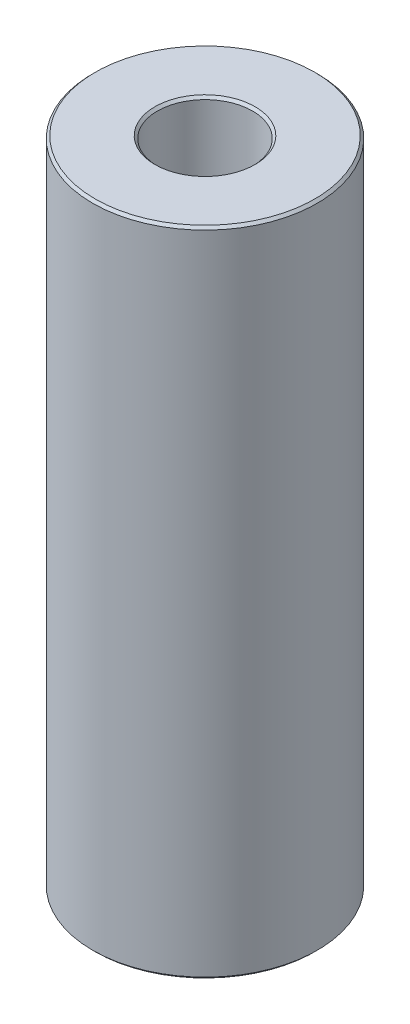
ISO-10303-21;
HEADER;
FILE_DESCRIPTION(('STEP AP214'),'2;1');
FILE_NAME('part.step','',(''),(''),'','','');
FILE_SCHEMA(('AUTOMOTIVE_DESIGN { 1 0 10303 214 1 1 1 1 }'));
ENDSEC;
DATA;
#1=APPLICATION_CONTEXT('core data for automotive mechanical design processes');
#2=APPLICATION_PROTOCOL_DEFINITION('international standard','automotive_design',2000,#1);
#3=PRODUCT_CONTEXT('',#1,'mechanical');
#4=PRODUCT('Part','Part','',(#3));
#5=PRODUCT_RELATED_PRODUCT_CATEGORY('part','',(#4));
#6=PRODUCT_DEFINITION_FORMATION('','',#4);
#7=PRODUCT_DEFINITION_CONTEXT('part definition',#1,'design');
#8=PRODUCT_DEFINITION('design','',#6,#7);
#9=PRODUCT_DEFINITION_SHAPE('','',#8);
#10=(LENGTH_UNIT() NAMED_UNIT(*) SI_UNIT(.MILLI.,.METRE.));
#11=(NAMED_UNIT(*) PLANE_ANGLE_UNIT() SI_UNIT($,.RADIAN.));
#12=(NAMED_UNIT(*) SI_UNIT($,.STERADIAN.) SOLID_ANGLE_UNIT());
#13=UNCERTAINTY_MEASURE_WITH_UNIT(LENGTH_MEASURE(1.E-05),#10,'distance_accuracy_value','');
#14=(GEOMETRIC_REPRESENTATION_CONTEXT(3) GLOBAL_UNCERTAINTY_ASSIGNED_CONTEXT((#13)) GLOBAL_UNIT_ASSIGNED_CONTEXT((#10,
#11,#12)) REPRESENTATION_CONTEXT('',''));
#15=CARTESIAN_POINT('',(0.,0.,0.));
#16=DIRECTION('',(0.,0.,1.));
#17=DIRECTION('',(1.,0.,0.));
#18=AXIS2_PLACEMENT_3D('',#15,#16,#17);
#19=CARTESIAN_POINT('',(0.,101.614682838386,0.));
#20=DIRECTION('',(0.,-1.,0.));
#21=DIRECTION('',(0.,0.,-1.));
#22=AXIS2_PLACEMENT_3D('',#19,#20,#21);
#23=CYLINDRICAL_SURFACE('',#22,17.5);
#24=CARTESIAN_POINT('',(0.,0.387153320517516,0.));
#25=DIRECTION('',(0.,1.,0.));
#26=DIRECTION('',(0.,0.,1.));
#27=AXIS2_PLACEMENT_3D('',#24,#25,#26);
#28=CIRCLE('',#27,17.5);
#29=CARTESIAN_POINT('',(0.,0.387153320517516,-17.5));
#30=VERTEX_POINT('',#29);
#31=EDGE_CURVE('E10',#30,#30,#28,.T.);
#32=CARTESIAN_POINT('',(0.,101.227529517869,0.));
#33=DIRECTION('',(0.,1.,0.));
#34=DIRECTION('',(0.,0.,1.));
#35=AXIS2_PLACEMENT_3D('',#32,#33,#34);
#36=CIRCLE('',#35,17.5);
#37=CARTESIAN_POINT('',(0.,101.227529517869,-17.5));
#38=VERTEX_POINT('',#37);
#39=EDGE_CURVE('E50',#38,#38,#36,.F.);
#40=CARTESIAN_POINT('',(0.,0.387153320517516,-17.5));
#41=CARTESIAN_POINT('',(0.,1.43757390590659,-17.5));
#42=CARTESIAN_POINT('',(0.,2.48799449129567,-17.5));
#43=CARTESIAN_POINT('',(0.,4.58883566207383,-17.5));
#44=CARTESIAN_POINT('',(0.,5.63925624746291,-17.5));
#45=CARTESIAN_POINT('',(0.,7.74009741824106,-17.5));
#46=CARTESIAN_POINT('',(0.,8.79051800363014,-17.5));
#47=CARTESIAN_POINT('',(0.,10.8913591744083,-17.5));
#48=CARTESIAN_POINT('',(0.,11.9417797597974,-17.5));
#49=CARTESIAN_POINT('',(0.,14.0426209305755,-17.5));
#50=CARTESIAN_POINT('',(0.,15.0930415159646,-17.5));
#51=CARTESIAN_POINT('',(0.,17.1938826867428,-17.5));
#52=CARTESIAN_POINT('',(0.,18.2443032721318,-17.5));
#53=CARTESIAN_POINT('',(0.,20.34514444291,-17.5));
#54=CARTESIAN_POINT('',(0.,21.3955650282991,-17.5));
#55=CARTESIAN_POINT('',(0.,23.4964061990772,-17.5));
#56=CARTESIAN_POINT('',(0.,24.5468267844663,-17.5));
#57=CARTESIAN_POINT('',(0.,26.6476679552445,-17.5));
#58=CARTESIAN_POINT('',(0.,27.6980885406335,-17.5));
#59=CARTESIAN_POINT('',(0.,29.7989297114117,-17.5));
#60=CARTESIAN_POINT('',(0.,30.8493502968008,-17.5));
#61=CARTESIAN_POINT('',(0.,32.9501914675789,-17.5));
#62=CARTESIAN_POINT('',(0.,34.000612052968,-17.5));
#63=CARTESIAN_POINT('',(0.,36.1014532237462,-17.5));
#64=CARTESIAN_POINT('',(0.,37.1518738091352,-17.5));
#65=CARTESIAN_POINT('',(0.,39.2527149799134,-17.5));
#66=CARTESIAN_POINT('',(0.,40.3031355653025,-17.5));
#67=CARTESIAN_POINT('',(0.,42.4039767360806,-17.5));
#68=CARTESIAN_POINT('',(0.,43.4543973214697,-17.5));
#69=CARTESIAN_POINT('',(0.,45.5552384922479,-17.5));
#70=CARTESIAN_POINT('',(0.,46.6056590776369,-17.5));
#71=CARTESIAN_POINT('',(0.,48.7065002484151,-17.5));
#72=CARTESIAN_POINT('',(0.,49.7569208338042,-17.5));
#73=CARTESIAN_POINT('',(0.,51.8577620045823,-17.5));
#74=CARTESIAN_POINT('',(0.,52.9081825899714,-17.5));
#75=CARTESIAN_POINT('',(0.,55.0090237607495,-17.5));
#76=CARTESIAN_POINT('',(0.,56.0594443461386,-17.5));
#77=CARTESIAN_POINT('',(0.,58.1602855169168,-17.5));
#78=CARTESIAN_POINT('',(0.,59.2107061023059,-17.5));
#79=CARTESIAN_POINT('',(0.,61.311547273084,-17.5));
#80=CARTESIAN_POINT('',(0.,62.3619678584731,-17.5));
#81=CARTESIAN_POINT('',(0.,64.4628090292513,-17.5));
#82=CARTESIAN_POINT('',(0.,65.5132296146403,-17.5));
#83=CARTESIAN_POINT('',(0.,67.6140707854185,-17.5));
#84=CARTESIAN_POINT('',(0.,68.6644913708076,-17.5));
#85=CARTESIAN_POINT('',(0.,70.7653325415857,-17.5));
#86=CARTESIAN_POINT('',(0.,71.8157531269748,-17.5));
#87=CARTESIAN_POINT('',(0.,73.916594297753,-17.5));
#88=CARTESIAN_POINT('',(0.,74.967014883142,-17.5));
#89=CARTESIAN_POINT('',(0.,77.0678560539202,-17.5));
#90=CARTESIAN_POINT('',(0.,78.1182766393093,-17.5));
#91=CARTESIAN_POINT('',(0.,80.2191178100874,-17.5));
#92=CARTESIAN_POINT('',(0.,81.2695383954765,-17.5));
#93=CARTESIAN_POINT('',(0.,83.3703795662547,-17.5));
#94=CARTESIAN_POINT('',(0.,84.4208001516437,-17.5));
#95=CARTESIAN_POINT('',(0.,86.5216413224219,-17.5));
#96=CARTESIAN_POINT('',(0.,87.572061907811,-17.5));
#97=CARTESIAN_POINT('',(0.,89.6729030785891,-17.5));
#98=CARTESIAN_POINT('',(0.,90.7233236639782,-17.5));
#99=CARTESIAN_POINT('',(0.,92.8241648347563,-17.5));
#100=CARTESIAN_POINT('',(0.,93.8745854201454,-17.5));
#101=CARTESIAN_POINT('',(0.,95.9754265909236,-17.5));
#102=CARTESIAN_POINT('',(0.,97.0258471763127,-17.5));
#103=CARTESIAN_POINT('',(0.,99.1266883470908,-17.5));
#104=CARTESIAN_POINT('',(0.,100.17710893248,-17.5));
#105=CARTESIAN_POINT('',(0.,101.227529517869,-17.5));
#106=B_SPLINE_CURVE_WITH_KNOTS('',3,(#40,#41,#42,#43,#44,#45,#46,#47,#48,#49,#50,#51,#52,#53,
#54,#55,#56,#57,#58,#59,#60,#61,#62,#63,#64,#65,#66,#67,#68,#69,#70,#71,#72,#73,#74,#75,#76,#77,
#78,#79,#80,#81,#82,#83,#84,#85,#86,#87,#88,#89,#90,#91,#92,#93,#94,#95,#96,#97,#98,#99,#100,
#101,#102,#103,#104,#105),.UNSPECIFIED.,.F.,.F.,(4,2,2,2,2,2,2,2,2,2,2,2,2,2,2,2,2,2,2,2,2,2,2,
2,2,2,2,2,2,2,2,2,4),(0.,3.15126175616723,6.30252351233447,9.4537852685017,12.6050470246689,
15.7563087808362,18.9075705370034,22.0588322931706,25.2100940493379,28.3613558055051,
31.5126175616723,34.6638793178396,37.8151410740068,40.966402830174,44.1176645863413,
47.2689263425085,50.4201880986757,53.571449854843,56.7227116110102,59.8739733671774,
63.0252351233447,66.1764968795119,69.3277586356791,72.4790203918463,75.6302821480136,
78.7815439041808,81.9328056603481,85.0840674165153,88.2353291726825,91.3865909288498,
94.537852685017,97.6891144411842,100.840376197351),.UNSPECIFIED.);
#107=EDGE_CURVE('BSEAM39',#30,#38,#106,.T.);
#108=ORIENTED_EDGE('',*,*,#31,.T.);
#109=ORIENTED_EDGE('',*,*,#39,.T.);
#110=ORIENTED_EDGE('',*,*,#107,.T.);
#111=ORIENTED_EDGE('',*,*,#107,.F.);
#112=EDGE_LOOP('',(#108,#110,#109,#111));
#113=FACE_BOUND('',#112,.T.);
#114=ADVANCED_FACE('F39',(#113),#23,.T.);
#115=CARTESIAN_POINT('',(0.,101.614682838386,0.));
#116=DIRECTION('',(0.,1.,0.));
#117=DIRECTION('',(0.,0.,1.));
#118=AXIS2_PLACEMENT_3D('',#115,#116,#117);
#119=PLANE('',#118);
#120=CARTESIAN_POINT('',(0.,101.614682838386,0.));
#121=DIRECTION('',(0.,1.,0.));
#122=DIRECTION('',(0.,0.,1.));
#123=AXIS2_PLACEMENT_3D('',#120,#121,#122);
#124=CIRCLE('',#123,7.80932673239515);
#125=CARTESIAN_POINT('',(0.,101.614682838386,7.80932673239515));
#126=VERTEX_POINT('',#125);
#127=EDGE_CURVE('E58',#126,#126,#124,.F.);
#128=ORIENTED_EDGE('',*,*,#127,.T.);
#129=EDGE_LOOP('',(#128));
#130=FACE_BOUND('',#129,.T.);
#131=CARTESIAN_POINT('',(0.,101.614682838386,0.));
#132=DIRECTION('',(0.,1.,0.));
#133=DIRECTION('',(0.,0.,1.));
#134=AXIS2_PLACEMENT_3D('',#131,#132,#133);
#135=CIRCLE('',#134,17.1128466794826);
#136=CARTESIAN_POINT('',(0.,101.614682838386,-17.1128466794826));
#137=VERTEX_POINT('',#136);
#138=EDGE_CURVE('E61',#137,#137,#135,.T.);
#139=ORIENTED_EDGE('',*,*,#138,.T.);
#140=EDGE_LOOP('',(#139));
#141=FACE_BOUND('',#140,.T.);
#142=ADVANCED_FACE('F88',(#130,#141),#119,.T.);
#143=CARTESIAN_POINT('',(0.,0.,0.));
#144=DIRECTION('',(0.,1.,0.));
#145=DIRECTION('',(0.,0.,1.));
#146=AXIS2_PLACEMENT_3D('',#143,#144,#145);
#147=PLANE('',#146);
#148=CARTESIAN_POINT('',(0.,0.,0.));
#149=DIRECTION('',(0.,1.,0.));
#150=DIRECTION('',(0.,0.,1.));
#151=AXIS2_PLACEMENT_3D('',#148,#149,#150);
#152=CIRCLE('',#151,7.80932673239507);
#153=CARTESIAN_POINT('',(0.,0.,7.80932673239507));
#154=VERTEX_POINT('',#153);
#155=EDGE_CURVE('E51',#154,#154,#152,.T.);
#156=ORIENTED_EDGE('',*,*,#155,.T.);
#157=EDGE_LOOP('',(#156));
#158=FACE_BOUND('',#157,.T.);
#159=CARTESIAN_POINT('',(0.,0.,0.));
#160=DIRECTION('',(0.,1.,0.));
#161=DIRECTION('',(0.,0.,1.));
#162=AXIS2_PLACEMENT_3D('',#159,#160,#161);
#163=CIRCLE('',#162,17.1128466794825);
#164=CARTESIAN_POINT('',(0.,0.,17.1128466794825));
#165=VERTEX_POINT('',#164);
#166=EDGE_CURVE('E54',#165,#165,#163,.F.);
#167=ORIENTED_EDGE('',*,*,#166,.T.);
#168=EDGE_LOOP('',(#167));
#169=FACE_BOUND('',#168,.T.);
#170=ADVANCED_FACE('F83',(#158,#169),#147,.F.);
#171=CARTESIAN_POINT('',(0.,101.614682838386,0.));
#172=DIRECTION('',(0.,-1.,0.));
#173=DIRECTION('',(0.,0.,-1.));
#174=AXIS2_PLACEMENT_3D('',#171,#172,#173);
#175=CYLINDRICAL_SURFACE('',#174,7.42217341187765);
#176=CARTESIAN_POINT('',(0.,101.227529517869,0.));
#177=DIRECTION('',(0.,1.,0.));
#178=DIRECTION('',(0.,0.,1.));
#179=AXIS2_PLACEMENT_3D('',#176,#177,#178);
#180=CIRCLE('',#179,7.42217341187765);
#181=CARTESIAN_POINT('',(0.,101.227529517869,-7.42217341187765));
#182=VERTEX_POINT('',#181);
#183=EDGE_CURVE('E67',#182,#182,#180,.T.);
#184=CARTESIAN_POINT('',(0.,0.387153320517419,0.));
#185=DIRECTION('',(0.,1.,0.));
#186=DIRECTION('',(0.,0.,1.));
#187=AXIS2_PLACEMENT_3D('',#184,#185,#186);
#188=CIRCLE('',#187,7.42217341187765);
#189=CARTESIAN_POINT('',(0.,0.387153320517405,-7.42217341187765));
#190=VERTEX_POINT('',#189);
#191=EDGE_CURVE('E69',#190,#190,#188,.F.);
#192=CARTESIAN_POINT('',(0.,101.227529517869,-7.42217341187765));
#193=CARTESIAN_POINT('',(0.,100.17710893248,-7.42217341187765));
#194=CARTESIAN_POINT('',(0.,99.1266883470907,-7.42217341187765));
#195=CARTESIAN_POINT('',(0.,97.0258471763126,-7.42217341187765));
#196=CARTESIAN_POINT('',(0.,95.9754265909235,-7.42217341187765));
#197=CARTESIAN_POINT('',(0.,93.8745854201453,-7.42217341187765));
#198=CARTESIAN_POINT('',(0.,92.8241648347562,-7.42217341187765));
#199=CARTESIAN_POINT('',(0.,90.7233236639781,-7.42217341187765));
#200=CARTESIAN_POINT('',(0.,89.672903078589,-7.42217341187765));
#201=CARTESIAN_POINT('',(0.,87.5720619078108,-7.42217341187765));
#202=CARTESIAN_POINT('',(0.,86.5216413224218,-7.42217341187765));
#203=CARTESIAN_POINT('',(0.,84.4208001516436,-7.42217341187765));
#204=CARTESIAN_POINT('',(0.,83.3703795662546,-7.42217341187765));
#205=CARTESIAN_POINT('',(0.,81.2695383954764,-7.42217341187765));
#206=CARTESIAN_POINT('',(0.,80.2191178100873,-7.42217341187765));
#207=CARTESIAN_POINT('',(0.,78.1182766393091,-7.42217341187765));
#208=CARTESIAN_POINT('',(0.,77.0678560539201,-7.42217341187765));
#209=CARTESIAN_POINT('',(0.,74.9670148831419,-7.42217341187765));
#210=CARTESIAN_POINT('',(0.,73.9165942977529,-7.42217341187765));
#211=CARTESIAN_POINT('',(0.,71.8157531269747,-7.42217341187765));
#212=CARTESIAN_POINT('',(0.,70.7653325415856,-7.42217341187765));
#213=CARTESIAN_POINT('',(0.,68.6644913708075,-7.42217341187765));
#214=CARTESIAN_POINT('',(0.,67.6140707854184,-7.42217341187765));
#215=CARTESIAN_POINT('',(0.,65.5132296146402,-7.42217341187765));
#216=CARTESIAN_POINT('',(0.,64.4628090292511,-7.42217341187765));
#217=CARTESIAN_POINT('',(0.,62.361967858473,-7.42217341187765));
#218=CARTESIAN_POINT('',(0.,61.3115472730839,-7.42217341187765));
#219=CARTESIAN_POINT('',(0.,59.2107061023058,-7.42217341187765));
#220=CARTESIAN_POINT('',(0.,58.1602855169167,-7.42217341187765));
#221=CARTESIAN_POINT('',(0.,56.0594443461385,-7.42217341187765));
#222=CARTESIAN_POINT('',(0.,55.0090237607495,-7.42217341187765));
#223=CARTESIAN_POINT('',(0.,52.9081825899713,-7.42217341187765));
#224=CARTESIAN_POINT('',(0.,51.8577620045822,-7.42217341187765));
#225=CARTESIAN_POINT('',(0.,49.7569208338041,-7.42217341187765));
#226=CARTESIAN_POINT('',(0.,48.706500248415,-7.42217341187765));
#227=CARTESIAN_POINT('',(0.,46.6056590776368,-7.42217341187765));
#228=CARTESIAN_POINT('',(0.,45.5552384922477,-7.42217341187765));
#229=CARTESIAN_POINT('',(0.,43.4543973214696,-7.42217341187765));
#230=CARTESIAN_POINT('',(0.,42.4039767360805,-7.42217341187765));
#231=CARTESIAN_POINT('',(0.,40.3031355653024,-7.42217341187765));
#232=CARTESIAN_POINT('',(0.,39.2527149799133,-7.42217341187765));
#233=CARTESIAN_POINT('',(0.,37.1518738091351,-7.42217341187765));
#234=CARTESIAN_POINT('',(0.,36.101453223746,-7.42217341187765));
#235=CARTESIAN_POINT('',(0.,34.0006120529679,-7.42217341187765));
#236=CARTESIAN_POINT('',(0.,32.9501914675788,-7.42217341187765));
#237=CARTESIAN_POINT('',(0.,30.8493502968007,-7.42217341187765));
#238=CARTESIAN_POINT('',(0.,29.7989297114116,-7.42217341187765));
#239=CARTESIAN_POINT('',(0.,27.6980885406334,-7.42217341187765));
#240=CARTESIAN_POINT('',(0.,26.6476679552444,-7.42217341187765));
#241=CARTESIAN_POINT('',(0.,24.5468267844662,-7.42217341187765));
#242=CARTESIAN_POINT('',(0.,23.4964061990771,-7.42217341187765));
#243=CARTESIAN_POINT('',(0.,21.395565028299,-7.42217341187765));
#244=CARTESIAN_POINT('',(0.,20.3451444429099,-7.42217341187765));
#245=CARTESIAN_POINT('',(0.,18.2443032721317,-7.42217341187765));
#246=CARTESIAN_POINT('',(0.,17.1938826867427,-7.42217341187765));
#247=CARTESIAN_POINT('',(0.,15.0930415159645,-7.42217341187765));
#248=CARTESIAN_POINT('',(0.,14.0426209305754,-7.42217341187765));
#249=CARTESIAN_POINT('',(0.,11.9417797597973,-7.42217341187765));
#250=CARTESIAN_POINT('',(0.,10.8913591744082,-7.42217341187765));
#251=CARTESIAN_POINT('',(0.,8.79051800363003,-7.42217341187765));
#252=CARTESIAN_POINT('',(0.,7.74009741824095,-7.42217341187765));
#253=CARTESIAN_POINT('',(0.,5.6392562474628,-7.42217341187765));
#254=CARTESIAN_POINT('',(0.,4.58883566207371,-7.42217341187765));
#255=CARTESIAN_POINT('',(0.,2.48799449129556,-7.42217341187765));
#256=CARTESIAN_POINT('',(0.,1.43757390590648,-7.42217341187765));
#257=CARTESIAN_POINT('',(0.,0.387153320517405,-7.42217341187765));
#258=B_SPLINE_CURVE_WITH_KNOTS('',3,(#192,#193,#194,#195,#196,#197,#198,#199,#200,#201,#202,
#203,#204,#205,#206,#207,#208,#209,#210,#211,#212,#213,#214,#215,#216,#217,#218,#219,#220,#221,
#222,#223,#224,#225,#226,#227,#228,#229,#230,#231,#232,#233,#234,#235,#236,#237,#238,#239,#240,
#241,#242,#243,#244,#245,#246,#247,#248,#249,#250,#251,#252,#253,#254,#255,#256,#257),
.UNSPECIFIED.,.F.,.F.,(4,2,2,2,2,2,2,2,2,2,2,2,2,2,2,2,2,2,2,2,2,2,2,2,2,2,2,2,2,2,2,2,4),(0.,
3.15126175616723,6.30252351233446,9.45378526850168,12.6050470246689,15.7563087808362,
18.9075705370034,22.0588322931706,25.2100940493379,28.3613558055051,31.5126175616723,
34.6638793178396,37.8151410740068,40.966402830174,44.1176645863413,47.2689263425085,
50.4201880986757,53.571449854843,56.7227116110102,59.8739733671774,63.0252351233447,
66.1764968795119,69.3277586356791,72.4790203918463,75.6302821480136,78.7815439041808,
81.9328056603481,85.0840674165153,88.2353291726825,91.3865909288498,94.537852685017,
97.6891144411842,100.840376197351),.UNSPECIFIED.);
#259=EDGE_CURVE('BSEAM71',#182,#190,#258,.T.);
#260=ORIENTED_EDGE('',*,*,#183,.T.);
#261=ORIENTED_EDGE('',*,*,#191,.T.);
#262=ORIENTED_EDGE('',*,*,#259,.T.);
#263=ORIENTED_EDGE('',*,*,#259,.F.);
#264=EDGE_LOOP('',(#260,#262,#261,#263));
#265=FACE_BOUND('',#264,.T.);
#266=ADVANCED_FACE('F71',(#265),#175,.F.);
#267=CARTESIAN_POINT('',(0.,101.227529517869,0.));
#268=DIRECTION('',(0.,1.,0.));
#269=DIRECTION('',(0.,0.,1.));
#270=AXIS2_PLACEMENT_3D('',#267,#268,#269);
#271=CONICAL_SURFACE('',#270,7.42217341187765,0.785398163397443);
#272=ORIENTED_EDGE('',*,*,#127,.F.);
#273=EDGE_LOOP('',(#272));
#274=FACE_BOUND('',#273,.T.);
#275=ORIENTED_EDGE('',*,*,#183,.F.);
#276=EDGE_LOOP('',(#275));
#277=FACE_BOUND('',#276,.T.);
#278=ADVANCED_FACE('F77',(#274,#277),#271,.F.);
#279=CARTESIAN_POINT('',(0.,0.,0.));
#280=DIRECTION('',(0.,-1.,0.));
#281=DIRECTION('',(0.,0.,-1.));
#282=AXIS2_PLACEMENT_3D('',#279,#280,#281);
#283=CONICAL_SURFACE('',#282,7.80932673239507,0.785398163397443);
#284=ORIENTED_EDGE('',*,*,#191,.F.);
#285=EDGE_LOOP('',(#284));
#286=FACE_BOUND('',#285,.T.);
#287=ORIENTED_EDGE('',*,*,#155,.F.);
#288=EDGE_LOOP('',(#287));
#289=FACE_BOUND('',#288,.T.);
#290=ADVANCED_FACE('F73',(#286,#289),#283,.F.);
#291=CARTESIAN_POINT('',(0.,0.387153320517516,0.));
#292=DIRECTION('',(0.,1.,0.));
#293=DIRECTION('',(0.,0.,1.));
#294=AXIS2_PLACEMENT_3D('',#291,#292,#293);
#295=CONICAL_SURFACE('',#294,17.5,0.785398163397439);
#296=ORIENTED_EDGE('',*,*,#166,.F.);
#297=EDGE_LOOP('',(#296));
#298=FACE_BOUND('',#297,.T.);
#299=ORIENTED_EDGE('',*,*,#31,.F.);
#300=EDGE_LOOP('',(#299));
#301=FACE_BOUND('',#300,.T.);
#302=ADVANCED_FACE('F76',(#298,#301),#295,.T.);
#303=CARTESIAN_POINT('',(0.,101.614682838386,0.));
#304=DIRECTION('',(0.,-1.,0.));
#305=DIRECTION('',(0.,0.,-1.));
#306=AXIS2_PLACEMENT_3D('',#303,#304,#305);
#307=CONICAL_SURFACE('',#306,17.1128466794826,0.785398163397457);
#308=CARTESIAN_POINT('',(0.,101.227529517869,-17.5));
#309=CARTESIAN_POINT('',(0.,101.231562364958,-17.4959671529113));
#310=CARTESIAN_POINT('',(0.,101.235595212046,-17.4919343058226));
#311=CARTESIAN_POINT('',(0.,101.243660906224,-17.4838686116451));
#312=CARTESIAN_POINT('',(0.,101.247693753313,-17.4798357645564));
#313=CARTESIAN_POINT('',(0.,101.25575944749,-17.471770070379));
#314=CARTESIAN_POINT('',(0.,101.259792294579,-17.4677372232902));
#315=CARTESIAN_POINT('',(0.,101.267857988756,-17.4596715291128));
#316=CARTESIAN_POINT('',(0.,101.271890835845,-17.4556386820241));
#317=CARTESIAN_POINT('',(0.,101.279956530022,-17.4475729878466));
#318=CARTESIAN_POINT('',(0.,101.283989377111,-17.4435401407579));
#319=CARTESIAN_POINT('',(0.,101.292055071289,-17.4354744465804));
#320=CARTESIAN_POINT('',(0.,101.296087918377,-17.4314415994917));
#321=CARTESIAN_POINT('',(0.,101.304153612555,-17.4233759053143));
#322=CARTESIAN_POINT('',(0.,101.308186459643,-17.4193430582256));
#323=CARTESIAN_POINT('',(0.,101.316252153821,-17.4112773640481));
#324=CARTESIAN_POINT('',(0.,101.32028500091,-17.4072445169594));
#325=CARTESIAN_POINT('',(0.,101.328350695087,-17.3991788227819));
#326=CARTESIAN_POINT('',(0.,101.332383542176,-17.3951459756932));
#327=CARTESIAN_POINT('',(0.,101.340449236353,-17.3870802815158));
#328=CARTESIAN_POINT('',(0.,101.344482083442,-17.383047434427));
#329=CARTESIAN_POINT('',(0.,101.352547777619,-17.3749817402496));
#330=CARTESIAN_POINT('',(0.,101.356580624708,-17.3709488931609));
#331=CARTESIAN_POINT('',(0.,101.364646318886,-17.3628831989834));
#332=CARTESIAN_POINT('',(0.,101.368679165974,-17.3588503518947));
#333=CARTESIAN_POINT('',(0.,101.376744860152,-17.3507846577173));
#334=CARTESIAN_POINT('',(0.,101.38077770724,-17.3467518106285));
#335=CARTESIAN_POINT('',(0.,101.388843401418,-17.3386861164511));
#336=CARTESIAN_POINT('',(0.,101.392876248507,-17.3346532693624));
#337=CARTESIAN_POINT('',(0.,101.400941942684,-17.3265875751849));
#338=CARTESIAN_POINT('',(0.,101.404974789773,-17.3225547280962));
#339=CARTESIAN_POINT('',(0.,101.41304048395,-17.3144890339188));
#340=CARTESIAN_POINT('',(0.,101.417073331039,-17.31045618683));
#341=CARTESIAN_POINT('',(0.,101.425139025216,-17.3023904926526));
#342=CARTESIAN_POINT('',(0.,101.429171872305,-17.2983576455639));
#343=CARTESIAN_POINT('',(0.,101.437237566483,-17.2902919513864));
#344=CARTESIAN_POINT('',(0.,101.441270413571,-17.2862591042977));
#345=CARTESIAN_POINT('',(0.,101.449336107749,-17.2781934101203));
#346=CARTESIAN_POINT('',(0.,101.453368954837,-17.2741605630315));
#347=CARTESIAN_POINT('',(0.,101.461434649015,-17.2660948688541));
#348=CARTESIAN_POINT('',(0.,101.465467496104,-17.2620620217654));
#349=CARTESIAN_POINT('',(0.,101.473533190281,-17.2539963275879));
#350=CARTESIAN_POINT('',(0.,101.47756603737,-17.2499634804992));
#351=CARTESIAN_POINT('',(0.,101.485631731547,-17.2418977863217));
#352=CARTESIAN_POINT('',(0.,101.489664578636,-17.237864939233));
#353=CARTESIAN_POINT('',(0.,101.497730272813,-17.2297992450556));
#354=CARTESIAN_POINT('',(0.,101.501763119902,-17.2257663979669));
#355=CARTESIAN_POINT('',(0.,101.50982881408,-17.2177007037894));
#356=CARTESIAN_POINT('',(0.,101.513861661168,-17.2136678567007));
#357=CARTESIAN_POINT('',(0.,101.521927355346,-17.2056021625232));
#358=CARTESIAN_POINT('',(0.,101.525960202434,-17.2015693154345));
#359=CARTESIAN_POINT('',(0.,101.534025896612,-17.1935036212571));
#360=CARTESIAN_POINT('',(0.,101.538058743701,-17.1894707741683));
#361=CARTESIAN_POINT('',(0.,101.546124437878,-17.1814050799909));
#362=CARTESIAN_POINT('',(0.,101.550157284967,-17.1773722329022));
#363=CARTESIAN_POINT('',(0.,101.558222979144,-17.1693065387247));
#364=CARTESIAN_POINT('',(0.,101.562255826233,-17.165273691636));
#365=CARTESIAN_POINT('',(0.,101.57032152041,-17.1572079974586));
#366=CARTESIAN_POINT('',(0.,101.574354367499,-17.1531751503698));
#367=CARTESIAN_POINT('',(0.,101.582420061677,-17.1451094561924));
#368=CARTESIAN_POINT('',(0.,101.586452908765,-17.1410766091037));
#369=CARTESIAN_POINT('',(0.,101.594518602943,-17.1330109149262));
#370=CARTESIAN_POINT('',(0.,101.598551450031,-17.1289780678375));
#371=CARTESIAN_POINT('',(0.,101.606617144209,-17.1209123736601));
#372=CARTESIAN_POINT('',(0.,101.610649991298,-17.1168795265713));
#373=CARTESIAN_POINT('',(0.,101.614682838386,-17.1128466794826));
#374=B_SPLINE_CURVE_WITH_KNOTS('',3,(#308,#309,#310,#311,#312,#313,#314,#315,#316,#317,#318,
#319,#320,#321,#322,#323,#324,#325,#326,#327,#328,#329,#330,#331,#332,#333,#334,#335,#336,#337,
#338,#339,#340,#341,#342,#343,#344,#345,#346,#347,#348,#349,#350,#351,#352,#353,#354,#355,#356,
#357,#358,#359,#360,#361,#362,#363,#364,#365,#366,#367,#368,#369,#370,#371,#372,#373),
.UNSPECIFIED.,.F.,.F.,(4,2,2,2,2,2,2,2,2,2,2,2,2,2,2,2,2,2,2,2,2,2,2,2,2,2,2,2,2,2,2,2,4),(0.,
0.0171099211435497,0.0342198422870994,0.0513297634306467,0.0684396845741866,0.0855496057177363,
0.102659526861286,0.119769448004826,0.136879369148373,0.153989290291923,0.171099211435463,
0.188209132579013,0.205319053722562,0.222428974866102,0.239538896009649,0.256648817153199,
0.273758738296739,0.290868659440289,0.307978580583838,0.325088501727386,0.342198422870926,
0.359308344014475,0.376418265158025,0.393528186301565,0.410638107445112,0.427748028588662,
0.444857949732202,0.461967870875751,0.479077792019301,0.496187713162841,0.513297634306388,
0.530407555449938,0.547517476593488),.UNSPECIFIED.);
#375=EDGE_CURVE('BSEAM45',#38,#137,#374,.T.);
#376=ORIENTED_EDGE('',*,*,#39,.F.);
#377=ORIENTED_EDGE('',*,*,#138,.F.);
#378=ORIENTED_EDGE('',*,*,#375,.T.);
#379=ORIENTED_EDGE('',*,*,#375,.F.);
#380=EDGE_LOOP('',(#376,#378,#377,#379));
#381=FACE_BOUND('',#380,.T.);
#382=ADVANCED_FACE('F45',(#381),#307,.T.);
#383=CLOSED_SHELL('',(#114,#142,#170,#266,#278,#290,#302,#382));
#384=MANIFOLD_SOLID_BREP('B2',#383);
#385=ADVANCED_BREP_SHAPE_REPRESENTATION('',(#18,#384),#14);
#386=SHAPE_DEFINITION_REPRESENTATION(#9,#385);
ENDSEC;
END-ISO-10303-21;
